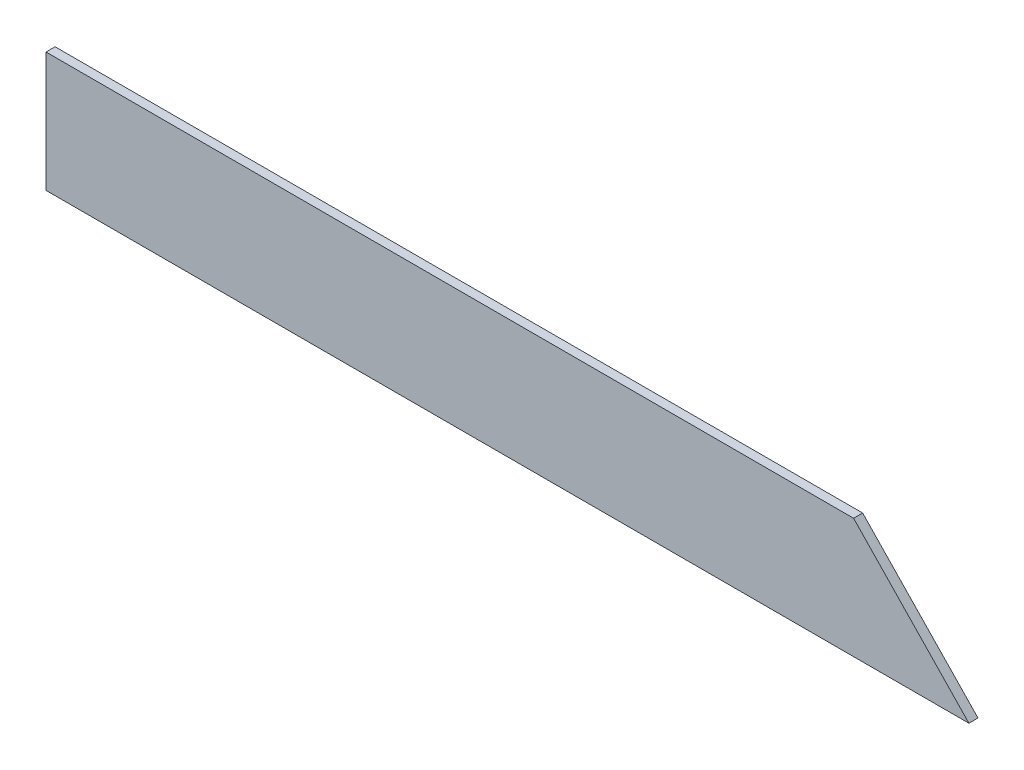
ISO-10303-21;
HEADER;
FILE_DESCRIPTION(('STEP AP214'),'2;1');
FILE_NAME('part.step','',(''),(''),'','','');
FILE_SCHEMA(('AUTOMOTIVE_DESIGN { 1 0 10303 214 1 1 1 1 }'));
ENDSEC;
DATA;
#1=APPLICATION_CONTEXT('core data for automotive mechanical design processes');
#2=APPLICATION_PROTOCOL_DEFINITION('international standard','automotive_design',2000,#1);
#3=PRODUCT_CONTEXT('',#1,'mechanical');
#4=PRODUCT('Part','Part','',(#3));
#5=PRODUCT_RELATED_PRODUCT_CATEGORY('part','',(#4));
#6=PRODUCT_DEFINITION_FORMATION('','',#4);
#7=PRODUCT_DEFINITION_CONTEXT('part definition',#1,'design');
#8=PRODUCT_DEFINITION('design','',#6,#7);
#9=PRODUCT_DEFINITION_SHAPE('','',#8);
#10=(LENGTH_UNIT() NAMED_UNIT(*) SI_UNIT(.MILLI.,.METRE.));
#11=(NAMED_UNIT(*) PLANE_ANGLE_UNIT() SI_UNIT($,.RADIAN.));
#12=(NAMED_UNIT(*) SI_UNIT($,.STERADIAN.) SOLID_ANGLE_UNIT());
#13=UNCERTAINTY_MEASURE_WITH_UNIT(LENGTH_MEASURE(1.E-05),#10,'distance_accuracy_value','');
#14=(GEOMETRIC_REPRESENTATION_CONTEXT(3) GLOBAL_UNCERTAINTY_ASSIGNED_CONTEXT((#13)) GLOBAL_UNIT_ASSIGNED_CONTEXT((#10,
#11,#12)) REPRESENTATION_CONTEXT('',''));
#15=CARTESIAN_POINT('',(0.,0.,0.));
#16=DIRECTION('',(0.,0.,1.));
#17=DIRECTION('',(1.,0.,0.));
#18=AXIS2_PLACEMENT_3D('',#15,#16,#17);
#19=CARTESIAN_POINT('',(-1129.39420368555,340.005513985111,18.25625));
#20=DIRECTION('',(1.,0.,0.));
#21=DIRECTION('',(0.,0.,-1.));
#22=AXIS2_PLACEMENT_3D('',#19,#20,#21);
#23=PLANE('',#22);
#24=DIRECTION('',(0.,-1.,0.));
#25=VECTOR('',#24,1.);
#26=CARTESIAN_POINT('',(-1129.39420368555,340.005513985111,0.));
#27=LINE('',#26,#25);
#28=CARTESIAN_POINT('',(-1129.39420368555,340.005513985111,0.));
#29=VERTEX_POINT('',#28);
#30=CARTESIAN_POINT('',(-1129.39420368555,98.7055139851113,0.));
#31=VERTEX_POINT('',#30);
#32=EDGE_CURVE('E95',#29,#31,#27,.T.);
#33=ORIENTED_EDGE('',*,*,#32,.T.);
#34=DIRECTION('',(0.,0.,-1.));
#35=VECTOR('',#34,1.);
#36=CARTESIAN_POINT('',(-1129.39420368555,98.7055139851113,18.25625));
#37=LINE('',#36,#35);
#38=CARTESIAN_POINT('',(-1129.39420368555,98.7055139851113,18.25625));
#39=VERTEX_POINT('',#38);
#40=EDGE_CURVE('E11',#39,#31,#37,.T.);
#41=ORIENTED_EDGE('',*,*,#40,.F.);
#42=DIRECTION('',(0.,-1.,0.));
#43=VECTOR('',#42,1.);
#44=CARTESIAN_POINT('',(-1129.39420368555,340.005513985111,18.25625));
#45=LINE('',#44,#43);
#46=CARTESIAN_POINT('',(-1129.39420368555,340.005513985111,18.25625));
#47=VERTEX_POINT('',#46);
#48=EDGE_CURVE('E83',#47,#39,#45,.T.);
#49=ORIENTED_EDGE('',*,*,#48,.F.);
#50=DIRECTION('',(0.,0.,-1.));
#51=VECTOR('',#50,1.);
#52=CARTESIAN_POINT('',(-1129.39420368555,340.005513985111,18.25625));
#53=LINE('',#52,#51);
#54=EDGE_CURVE('E91',#47,#29,#53,.T.);
#55=ORIENTED_EDGE('',*,*,#54,.T.);
#56=EDGE_LOOP('',(#33,#41,#49,#55));
#57=FACE_BOUND('',#56,.T.);
#58=ADVANCED_FACE('F32',(#57),#23,.F.);
#59=CARTESIAN_POINT('',(-1129.39420368555,98.7055139851113,18.25625));
#60=DIRECTION('',(0.,1.,0.));
#61=DIRECTION('',(0.,0.,1.));
#62=AXIS2_PLACEMENT_3D('',#59,#60,#61);
#63=PLANE('',#62);
#64=DIRECTION('',(1.,0.,0.));
#65=VECTOR('',#64,1.);
#66=CARTESIAN_POINT('',(-1129.39420368555,98.7055139851113,0.));
#67=LINE('',#66,#65);
#68=CARTESIAN_POINT('',(728.361796314447,98.7055139851113,0.));
#69=VERTEX_POINT('',#68);
#70=EDGE_CURVE('E87',#31,#69,#67,.T.);
#71=ORIENTED_EDGE('',*,*,#70,.T.);
#72=DIRECTION('',(0.,0.,-1.));
#73=VECTOR('',#72,1.);
#74=CARTESIAN_POINT('',(728.361796314447,98.7055139851113,18.25625));
#75=LINE('',#74,#73);
#76=CARTESIAN_POINT('',(728.361796314447,98.7055139851113,18.25625));
#77=VERTEX_POINT('',#76);
#78=EDGE_CURVE('E40',#77,#69,#75,.T.);
#79=ORIENTED_EDGE('',*,*,#78,.F.);
#80=DIRECTION('',(1.,0.,0.));
#81=VECTOR('',#80,1.);
#82=CARTESIAN_POINT('',(-1129.39420368555,98.7055139851113,18.25625));
#83=LINE('',#82,#81);
#84=EDGE_CURVE('E78',#39,#77,#83,.T.);
#85=ORIENTED_EDGE('',*,*,#84,.F.);
#86=ORIENTED_EDGE('',*,*,#40,.T.);
#87=EDGE_LOOP('',(#71,#79,#85,#86));
#88=FACE_BOUND('',#87,.T.);
#89=ADVANCED_FACE('F86',(#88),#63,.F.);
#90=CARTESIAN_POINT('',(728.361796314447,98.7055139851113,18.25625));
#91=DIRECTION('',(-0.720628963803319,-0.693320918859193,0.));
#92=DIRECTION('',(0.693320918859193,-0.720628963803319,0.));
#93=AXIS2_PLACEMENT_3D('',#90,#91,#92);
#94=PLANE('',#93);
#95=DIRECTION('',(-0.693320918859193,0.720628963803318,0.));
#96=VECTOR('',#95,1.);
#97=CARTESIAN_POINT('',(728.361796314447,98.7055139851113,0.));
#98=LINE('',#97,#96);
#99=CARTESIAN_POINT('',(496.205796314447,340.005513985111,0.));
#100=VERTEX_POINT('',#99);
#101=EDGE_CURVE('E65',#69,#100,#98,.T.);
#102=ORIENTED_EDGE('',*,*,#101,.T.);
#103=DIRECTION('',(0.,0.,-1.));
#104=VECTOR('',#103,1.);
#105=CARTESIAN_POINT('',(496.205796314447,340.005513985111,18.25625));
#106=LINE('',#105,#104);
#107=CARTESIAN_POINT('',(496.205796314447,340.005513985111,18.25625));
#108=VERTEX_POINT('',#107);
#109=EDGE_CURVE('E88',#108,#100,#106,.T.);
#110=ORIENTED_EDGE('',*,*,#109,.F.);
#111=DIRECTION('',(-0.693320918859193,0.720628963803318,0.));
#112=VECTOR('',#111,1.);
#113=CARTESIAN_POINT('',(728.361796314447,98.7055139851113,18.25625));
#114=LINE('',#113,#112);
#115=EDGE_CURVE('E81',#77,#108,#114,.T.);
#116=ORIENTED_EDGE('',*,*,#115,.F.);
#117=ORIENTED_EDGE('',*,*,#78,.T.);
#118=EDGE_LOOP('',(#102,#110,#116,#117));
#119=FACE_BOUND('',#118,.T.);
#120=ADVANCED_FACE('F89',(#119),#94,.F.);
#121=CARTESIAN_POINT('',(-1129.39420368555,340.005513985111,18.25625));
#122=DIRECTION('',(0.,-1.,0.));
#123=DIRECTION('',(0.,0.,-1.));
#124=AXIS2_PLACEMENT_3D('',#121,#122,#123);
#125=PLANE('',#124);
#126=DIRECTION('',(-1.,0.,0.));
#127=VECTOR('',#126,1.);
#128=CARTESIAN_POINT('',(-1129.39420368555,340.005513985111,0.));
#129=LINE('',#128,#127);
#130=EDGE_CURVE('E71',#100,#29,#129,.T.);
#131=ORIENTED_EDGE('',*,*,#130,.T.);
#132=ORIENTED_EDGE('',*,*,#54,.F.);
#133=DIRECTION('',(-1.,0.,0.));
#134=VECTOR('',#133,1.);
#135=CARTESIAN_POINT('',(-1129.39420368555,340.005513985111,18.25625));
#136=LINE('',#135,#134);
#137=EDGE_CURVE('E48',#108,#47,#136,.T.);
#138=ORIENTED_EDGE('',*,*,#137,.F.);
#139=ORIENTED_EDGE('',*,*,#109,.T.);
#140=EDGE_LOOP('',(#131,#132,#138,#139));
#141=FACE_BOUND('',#140,.T.);
#142=ADVANCED_FACE('F102',(#141),#125,.F.);
#143=CARTESIAN_POINT('',(0.,0.,18.25625));
#144=DIRECTION('',(0.,0.,1.));
#145=DIRECTION('',(1.,0.,0.));
#146=AXIS2_PLACEMENT_3D('',#143,#144,#145);
#147=PLANE('',#146);
#148=ORIENTED_EDGE('',*,*,#48,.T.);
#149=ORIENTED_EDGE('',*,*,#84,.T.);
#150=ORIENTED_EDGE('',*,*,#115,.T.);
#151=ORIENTED_EDGE('',*,*,#137,.T.);
#152=EDGE_LOOP('',(#148,#149,#150,#151));
#153=FACE_BOUND('',#152,.T.);
#154=ADVANCED_FACE('F79',(#153),#147,.T.);
#155=CARTESIAN_POINT('',(0.,0.,0.));
#156=DIRECTION('',(0.,0.,1.));
#157=DIRECTION('',(1.,0.,0.));
#158=AXIS2_PLACEMENT_3D('',#155,#156,#157);
#159=PLANE('',#158);
#160=ORIENTED_EDGE('',*,*,#32,.F.);
#161=ORIENTED_EDGE('',*,*,#130,.F.);
#162=ORIENTED_EDGE('',*,*,#101,.F.);
#163=ORIENTED_EDGE('',*,*,#70,.F.);
#164=EDGE_LOOP('',(#160,#161,#162,#163));
#165=FACE_BOUND('',#164,.T.);
#166=ADVANCED_FACE('F105',(#165),#159,.F.);
#167=CLOSED_SHELL('',(#58,#89,#120,#142,#154,#166));
#168=MANIFOLD_SOLID_BREP('B2',#167);
#169=ADVANCED_BREP_SHAPE_REPRESENTATION('',(#18,#168),#14);
#170=SHAPE_DEFINITION_REPRESENTATION(#9,#169);
ENDSEC;
END-ISO-10303-21;
